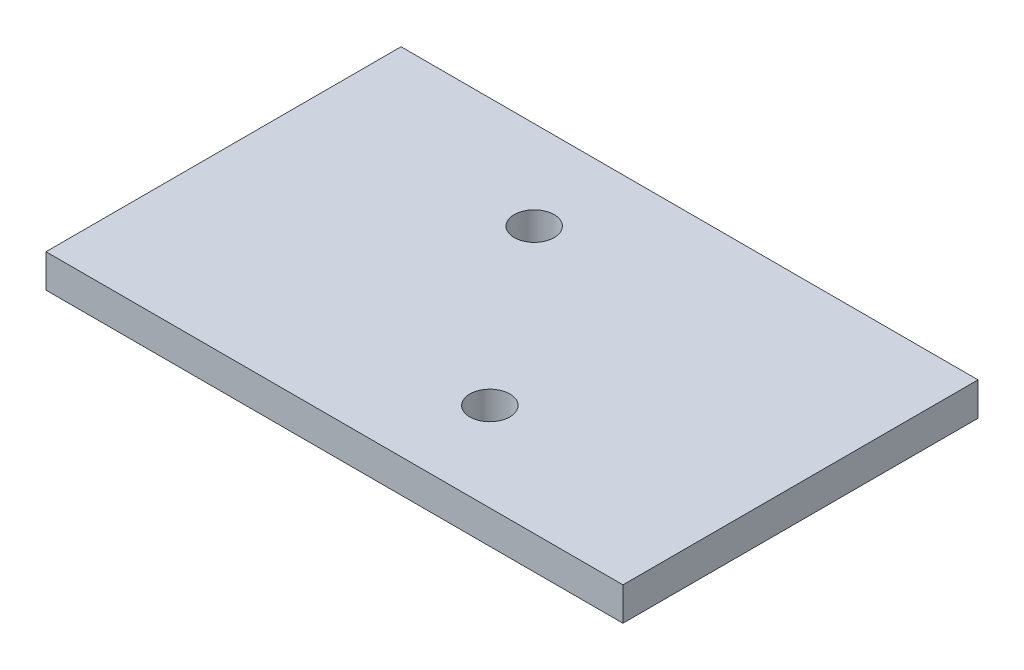
ISO-10303-21;
HEADER;
FILE_DESCRIPTION(('STEP AP214'),'2;1');
FILE_NAME('part.step','',(''),(''),'','','');
FILE_SCHEMA(('AUTOMOTIVE_DESIGN { 1 0 10303 214 1 1 1 1 }'));
ENDSEC;
DATA;
#1=APPLICATION_CONTEXT('core data for automotive mechanical design processes');
#2=APPLICATION_PROTOCOL_DEFINITION('international standard','automotive_design',2000,#1);
#3=PRODUCT_CONTEXT('',#1,'mechanical');
#4=PRODUCT('Part','Part','',(#3));
#5=PRODUCT_RELATED_PRODUCT_CATEGORY('part','',(#4));
#6=PRODUCT_DEFINITION_FORMATION('','',#4);
#7=PRODUCT_DEFINITION_CONTEXT('part definition',#1,'design');
#8=PRODUCT_DEFINITION('design','',#6,#7);
#9=PRODUCT_DEFINITION_SHAPE('','',#8);
#10=(LENGTH_UNIT() NAMED_UNIT(*) SI_UNIT(.MILLI.,.METRE.));
#11=(NAMED_UNIT(*) PLANE_ANGLE_UNIT() SI_UNIT($,.RADIAN.));
#12=(NAMED_UNIT(*) SI_UNIT($,.STERADIAN.) SOLID_ANGLE_UNIT());
#13=UNCERTAINTY_MEASURE_WITH_UNIT(LENGTH_MEASURE(1.E-05),#10,'distance_accuracy_value','');
#14=(GEOMETRIC_REPRESENTATION_CONTEXT(3) GLOBAL_UNCERTAINTY_ASSIGNED_CONTEXT((#13)) GLOBAL_UNIT_ASSIGNED_CONTEXT((#10,
#11,#12)) REPRESENTATION_CONTEXT('',''));
#15=CARTESIAN_POINT('',(0.,0.,0.));
#16=DIRECTION('',(0.,0.,1.));
#17=DIRECTION('',(1.,0.,0.));
#18=AXIS2_PLACEMENT_3D('',#15,#16,#17);
#19=CARTESIAN_POINT('',(13.,1.5,8.));
#20=DIRECTION('',(-1.,0.,0.));
#21=DIRECTION('',(0.,0.,1.));
#22=AXIS2_PLACEMENT_3D('',#19,#20,#21);
#23=PLANE('',#22);
#24=DIRECTION('',(0.,0.,-1.));
#25=VECTOR('',#24,1.);
#26=CARTESIAN_POINT('',(13.,0.,8.));
#27=LINE('',#26,#25);
#28=CARTESIAN_POINT('',(13.,0.,8.));
#29=VERTEX_POINT('',#28);
#30=CARTESIAN_POINT('',(13.,0.,-8.));
#31=VERTEX_POINT('',#30);
#32=EDGE_CURVE('E106',#29,#31,#27,.T.);
#33=ORIENTED_EDGE('',*,*,#32,.T.);
#34=DIRECTION('',(0.,-1.,0.));
#35=VECTOR('',#34,1.);
#36=CARTESIAN_POINT('',(13.,1.5,-8.));
#37=LINE('',#36,#35);
#38=CARTESIAN_POINT('',(13.,1.5,-8.));
#39=VERTEX_POINT('',#38);
#40=EDGE_CURVE('E11',#39,#31,#37,.T.);
#41=ORIENTED_EDGE('',*,*,#40,.F.);
#42=DIRECTION('',(0.,0.,-1.));
#43=VECTOR('',#42,1.);
#44=CARTESIAN_POINT('',(13.,1.5,8.));
#45=LINE('',#44,#43);
#46=CARTESIAN_POINT('',(13.,1.5,8.));
#47=VERTEX_POINT('',#46);
#48=EDGE_CURVE('E90',#47,#39,#45,.T.);
#49=ORIENTED_EDGE('',*,*,#48,.F.);
#50=DIRECTION('',(0.,-1.,0.));
#51=VECTOR('',#50,1.);
#52=CARTESIAN_POINT('',(13.,1.5,8.));
#53=LINE('',#52,#51);
#54=EDGE_CURVE('E102',#47,#29,#53,.T.);
#55=ORIENTED_EDGE('',*,*,#54,.T.);
#56=EDGE_LOOP('',(#33,#41,#49,#55));
#57=FACE_BOUND('',#56,.T.);
#58=ADVANCED_FACE('F38',(#57),#23,.F.);
#59=CARTESIAN_POINT('',(-13.,1.5,-8.));
#60=DIRECTION('',(0.,0.,1.));
#61=DIRECTION('',(1.,0.,0.));
#62=AXIS2_PLACEMENT_3D('',#59,#60,#61);
#63=PLANE('',#62);
#64=DIRECTION('',(-1.,0.,0.));
#65=VECTOR('',#64,1.);
#66=CARTESIAN_POINT('',(-13.,0.,-8.));
#67=LINE('',#66,#65);
#68=CARTESIAN_POINT('',(-13.,0.,-8.));
#69=VERTEX_POINT('',#68);
#70=EDGE_CURVE('E95',#31,#69,#67,.T.);
#71=ORIENTED_EDGE('',*,*,#70,.T.);
#72=DIRECTION('',(0.,-1.,0.));
#73=VECTOR('',#72,1.);
#74=CARTESIAN_POINT('',(-13.,1.5,-8.));
#75=LINE('',#74,#73);
#76=CARTESIAN_POINT('',(-13.,1.5,-8.));
#77=VERTEX_POINT('',#76);
#78=EDGE_CURVE('E47',#77,#69,#75,.T.);
#79=ORIENTED_EDGE('',*,*,#78,.F.);
#80=DIRECTION('',(-1.,0.,0.));
#81=VECTOR('',#80,1.);
#82=CARTESIAN_POINT('',(-13.,1.5,-8.));
#83=LINE('',#82,#81);
#84=EDGE_CURVE('E85',#39,#77,#83,.T.);
#85=ORIENTED_EDGE('',*,*,#84,.F.);
#86=ORIENTED_EDGE('',*,*,#40,.T.);
#87=EDGE_LOOP('',(#71,#79,#85,#86));
#88=FACE_BOUND('',#87,.T.);
#89=ADVANCED_FACE('F94',(#88),#63,.F.);
#90=CARTESIAN_POINT('',(-13.,1.5,8.));
#91=DIRECTION('',(1.,0.,0.));
#92=DIRECTION('',(0.,0.,-1.));
#93=AXIS2_PLACEMENT_3D('',#90,#91,#92);
#94=PLANE('',#93);
#95=DIRECTION('',(0.,0.,1.));
#96=VECTOR('',#95,1.);
#97=CARTESIAN_POINT('',(-13.,0.,8.));
#98=LINE('',#97,#96);
#99=CARTESIAN_POINT('',(-13.,0.,8.));
#100=VERTEX_POINT('',#99);
#101=EDGE_CURVE('E72',#69,#100,#98,.T.);
#102=ORIENTED_EDGE('',*,*,#101,.T.);
#103=DIRECTION('',(0.,-1.,0.));
#104=VECTOR('',#103,1.);
#105=CARTESIAN_POINT('',(-13.,1.5,8.));
#106=LINE('',#105,#104);
#107=CARTESIAN_POINT('',(-13.,1.5,8.));
#108=VERTEX_POINT('',#107);
#109=EDGE_CURVE('E97',#108,#100,#106,.T.);
#110=ORIENTED_EDGE('',*,*,#109,.F.);
#111=DIRECTION('',(0.,0.,1.));
#112=VECTOR('',#111,1.);
#113=CARTESIAN_POINT('',(-13.,1.5,8.));
#114=LINE('',#113,#112);
#115=EDGE_CURVE('E88',#77,#108,#114,.T.);
#116=ORIENTED_EDGE('',*,*,#115,.F.);
#117=ORIENTED_EDGE('',*,*,#78,.T.);
#118=EDGE_LOOP('',(#102,#110,#116,#117));
#119=FACE_BOUND('',#118,.T.);
#120=ADVANCED_FACE('F98',(#119),#94,.F.);
#121=CARTESIAN_POINT('',(-13.,1.5,8.));
#122=DIRECTION('',(0.,0.,-1.));
#123=DIRECTION('',(-1.,0.,0.));
#124=AXIS2_PLACEMENT_3D('',#121,#122,#123);
#125=PLANE('',#124);
#126=DIRECTION('',(1.,0.,0.));
#127=VECTOR('',#126,1.);
#128=CARTESIAN_POINT('',(-13.,0.,8.));
#129=LINE('',#128,#127);
#130=EDGE_CURVE('E78',#100,#29,#129,.T.);
#131=ORIENTED_EDGE('',*,*,#130,.T.);
#132=ORIENTED_EDGE('',*,*,#54,.F.);
#133=DIRECTION('',(1.,0.,0.));
#134=VECTOR('',#133,1.);
#135=CARTESIAN_POINT('',(-13.,1.5,8.));
#136=LINE('',#135,#134);
#137=EDGE_CURVE('E55',#108,#47,#136,.T.);
#138=ORIENTED_EDGE('',*,*,#137,.F.);
#139=ORIENTED_EDGE('',*,*,#109,.T.);
#140=EDGE_LOOP('',(#131,#132,#138,#139));
#141=FACE_BOUND('',#140,.T.);
#142=ADVANCED_FACE('F120',(#141),#125,.F.);
#143=CARTESIAN_POINT('',(0.,1.5,0.));
#144=DIRECTION('',(0.,-1.,0.));
#145=DIRECTION('',(0.,0.,-1.));
#146=AXIS2_PLACEMENT_3D('',#143,#144,#145);
#147=PLANE('',#146);
#148=CARTESIAN_POINT('',(-3.00000000000001,1.5,-4.));
#149=DIRECTION('',(0.,1.,0.));
#150=DIRECTION('',(0.,0.,1.));
#151=AXIS2_PLACEMENT_3D('',#148,#149,#150);
#152=CIRCLE('',#151,0.899999999999988);
#153=CARTESIAN_POINT('',(-3.00000000000001,1.5,-3.10000000000001));
#154=VERTEX_POINT('',#153);
#155=EDGE_CURVE('E138',#154,#154,#152,.T.);
#156=ORIENTED_EDGE('',*,*,#155,.F.);
#157=EDGE_LOOP('',(#156));
#158=FACE_BOUND('',#157,.T.);
#159=CARTESIAN_POINT('',(3.,1.5,4.));
#160=DIRECTION('',(0.,1.,0.));
#161=DIRECTION('',(0.,0.,1.));
#162=AXIS2_PLACEMENT_3D('',#159,#160,#161);
#163=CIRCLE('',#162,0.899999999999988);
#164=CARTESIAN_POINT('',(3.,1.5,4.89999999999999));
#165=VERTEX_POINT('',#164);
#166=EDGE_CURVE('E130',#165,#165,#163,.T.);
#167=ORIENTED_EDGE('',*,*,#166,.F.);
#168=EDGE_LOOP('',(#167));
#169=FACE_BOUND('',#168,.T.);
#170=ORIENTED_EDGE('',*,*,#48,.T.);
#171=ORIENTED_EDGE('',*,*,#84,.T.);
#172=ORIENTED_EDGE('',*,*,#115,.T.);
#173=ORIENTED_EDGE('',*,*,#137,.T.);
#174=EDGE_LOOP('',(#170,#171,#172,#173));
#175=FACE_BOUND('',#174,.T.);
#176=ADVANCED_FACE('F86',(#158,#169,#175),#147,.F.);
#177=CARTESIAN_POINT('',(0.,0.,0.));
#178=DIRECTION('',(0.,-1.,0.));
#179=DIRECTION('',(0.,0.,-1.));
#180=AXIS2_PLACEMENT_3D('',#177,#178,#179);
#181=PLANE('',#180);
#182=CARTESIAN_POINT('',(-3.00000000000001,0.,-4.));
#183=DIRECTION('',(0.,1.,0.));
#184=DIRECTION('',(0.,0.,1.));
#185=AXIS2_PLACEMENT_3D('',#182,#183,#184);
#186=CIRCLE('',#185,0.9);
#187=CARTESIAN_POINT('',(-3.00000000000001,0.,-3.1));
#188=VERTEX_POINT('',#187);
#189=EDGE_CURVE('E134',#188,#188,#186,.T.);
#190=ORIENTED_EDGE('',*,*,#189,.T.);
#191=EDGE_LOOP('',(#190));
#192=FACE_BOUND('',#191,.T.);
#193=CARTESIAN_POINT('',(3.,0.,4.));
#194=DIRECTION('',(0.,1.,0.));
#195=DIRECTION('',(0.,0.,1.));
#196=AXIS2_PLACEMENT_3D('',#193,#194,#195);
#197=CIRCLE('',#196,0.9);
#198=CARTESIAN_POINT('',(3.,0.,4.9));
#199=VERTEX_POINT('',#198);
#200=EDGE_CURVE('E110',#199,#199,#197,.T.);
#201=ORIENTED_EDGE('',*,*,#200,.T.);
#202=EDGE_LOOP('',(#201));
#203=FACE_BOUND('',#202,.T.);
#204=ORIENTED_EDGE('',*,*,#32,.F.);
#205=ORIENTED_EDGE('',*,*,#130,.F.);
#206=ORIENTED_EDGE('',*,*,#101,.F.);
#207=ORIENTED_EDGE('',*,*,#70,.F.);
#208=EDGE_LOOP('',(#204,#205,#206,#207));
#209=FACE_BOUND('',#208,.T.);
#210=ADVANCED_FACE('F123',(#192,#203,#209),#181,.T.);
#211=CARTESIAN_POINT('',(3.,1.5,4.));
#212=DIRECTION('',(0.,1.,0.));
#213=DIRECTION('',(0.,0.,1.));
#214=AXIS2_PLACEMENT_3D('',#211,#212,#213);
#215=CYLINDRICAL_SURFACE('',#214,0.899999999999994);
#216=ORIENTED_EDGE('',*,*,#200,.F.);
#217=EDGE_LOOP('',(#216));
#218=FACE_BOUND('',#217,.T.);
#219=ORIENTED_EDGE('',*,*,#166,.T.);
#220=EDGE_LOOP('',(#219));
#221=FACE_BOUND('',#220,.T.);
#222=ADVANCED_FACE('F150',(#218,#221),#215,.F.);
#223=CARTESIAN_POINT('',(-3.00000000000001,1.5,-4.));
#224=DIRECTION('',(0.,1.,0.));
#225=DIRECTION('',(0.,0.,1.));
#226=AXIS2_PLACEMENT_3D('',#223,#224,#225);
#227=CYLINDRICAL_SURFACE('',#226,0.899999999999994);
#228=ORIENTED_EDGE('',*,*,#189,.F.);
#229=EDGE_LOOP('',(#228));
#230=FACE_BOUND('',#229,.T.);
#231=ORIENTED_EDGE('',*,*,#155,.T.);
#232=EDGE_LOOP('',(#231));
#233=FACE_BOUND('',#232,.T.);
#234=ADVANCED_FACE('F143',(#230,#233),#227,.F.);
#235=CLOSED_SHELL('',(#58,#89,#120,#142,#176,#210,#222,#234));
#236=MANIFOLD_SOLID_BREP('B2',#235);
#237=ADVANCED_BREP_SHAPE_REPRESENTATION('',(#18,#236),#14);
#238=SHAPE_DEFINITION_REPRESENTATION(#9,#237);
ENDSEC;
END-ISO-10303-21;
